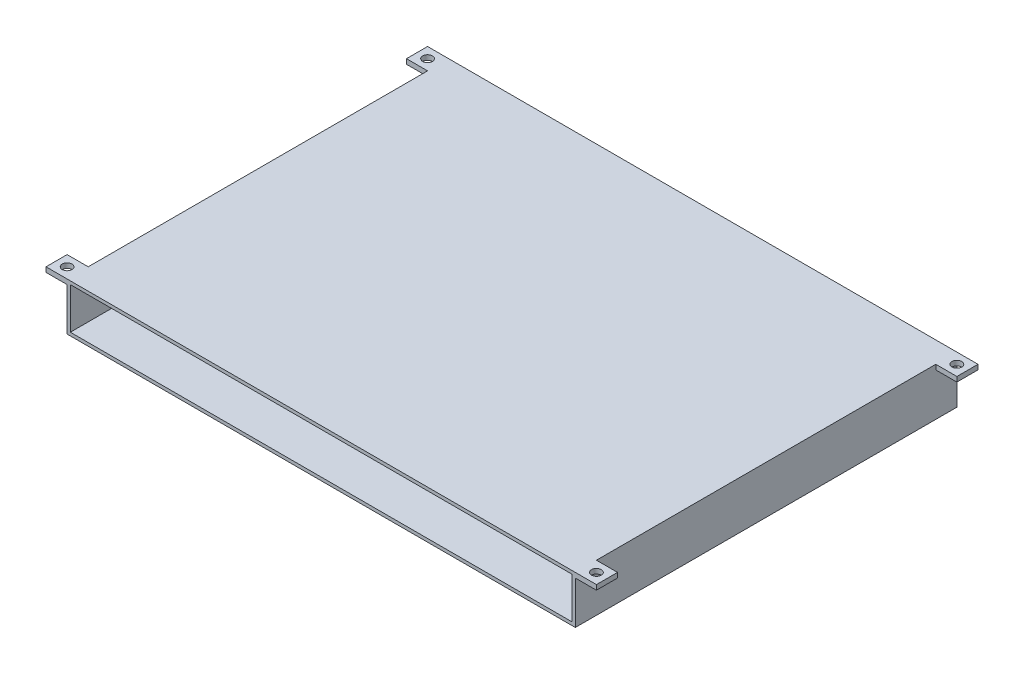
ISO-10303-21;
HEADER;
FILE_DESCRIPTION(('STEP AP214'),'2;1');
FILE_NAME('part.step','',(''),(''),'','','');
FILE_SCHEMA(('AUTOMOTIVE_DESIGN { 1 0 10303 214 1 1 1 1 }'));
ENDSEC;
DATA;
#1=APPLICATION_CONTEXT('core data for automotive mechanical design processes');
#2=APPLICATION_PROTOCOL_DEFINITION('international standard','automotive_design',2000,#1);
#3=PRODUCT_CONTEXT('',#1,'mechanical');
#4=PRODUCT('Part','Part','',(#3));
#5=PRODUCT_RELATED_PRODUCT_CATEGORY('part','',(#4));
#6=PRODUCT_DEFINITION_FORMATION('','',#4);
#7=PRODUCT_DEFINITION_CONTEXT('part definition',#1,'design');
#8=PRODUCT_DEFINITION('design','',#6,#7);
#9=PRODUCT_DEFINITION_SHAPE('','',#8);
#10=(LENGTH_UNIT() NAMED_UNIT(*) SI_UNIT(.MILLI.,.METRE.));
#11=(NAMED_UNIT(*) PLANE_ANGLE_UNIT() SI_UNIT($,.RADIAN.));
#12=(NAMED_UNIT(*) SI_UNIT($,.STERADIAN.) SOLID_ANGLE_UNIT());
#13=UNCERTAINTY_MEASURE_WITH_UNIT(LENGTH_MEASURE(1.E-05),#10,'distance_accuracy_value','');
#14=(GEOMETRIC_REPRESENTATION_CONTEXT(3) GLOBAL_UNCERTAINTY_ASSIGNED_CONTEXT((#13)) GLOBAL_UNIT_ASSIGNED_CONTEXT((#10,
#11,#12)) REPRESENTATION_CONTEXT('',''));
#15=CARTESIAN_POINT('',(0.,0.,0.));
#16=DIRECTION('',(0.,0.,1.));
#17=DIRECTION('',(1.,0.,0.));
#18=AXIS2_PLACEMENT_3D('',#15,#16,#17);
#19=CARTESIAN_POINT('',(-36.9999999998552,9.69999999999824,-32.9999999999999));
#20=DIRECTION('',(7.35349281466569E-13,1.,0.));
#21=DIRECTION('',(-1.,7.35349281466569E-13,0.));
#22=AXIS2_PLACEMENT_3D('',#19,#20,#21);
#23=PLANE('',#22);
#24=DIRECTION('',(1.,-7.35349281466568E-13,0.));
#25=VECTOR('',#24,1.);
#26=CARTESIAN_POINT('',(-36.9999999998552,9.69999999999824,-233.));
#27=LINE('',#26,#25);
#28=CARTESIAN_POINT('',(-36.9999999998552,9.69999999999824,-233.));
#29=VERTEX_POINT('',#28);
#30=CARTESIAN_POINT('',(-26.9999999998552,9.69999999999089,-233.));
#31=VERTEX_POINT('',#30);
#32=EDGE_CURVE('E107',#29,#31,#27,.T.);
#33=ORIENTED_EDGE('',*,*,#32,.F.);
#34=DIRECTION('',(0.,0.,-1.));
#35=VECTOR('',#34,1.);
#36=CARTESIAN_POINT('',(-36.9999999998552,9.69999999999824,-32.9999999999999));
#37=LINE('',#36,#35);
#38=CARTESIAN_POINT('',(-36.9999999998552,9.69999999999824,-32.9999999999999));
#39=VERTEX_POINT('',#38);
#40=EDGE_CURVE('E56',#39,#29,#37,.T.);
#41=ORIENTED_EDGE('',*,*,#40,.F.);
#42=DIRECTION('',(1.,-7.35349281466568E-13,0.));
#43=VECTOR('',#42,1.);
#44=CARTESIAN_POINT('',(-36.9999999998552,9.69999999999824,-32.9999999999999));
#45=LINE('',#44,#43);
#46=CARTESIAN_POINT('',(-26.9999999998552,9.69999999999089,-32.9999999999999));
#47=VERTEX_POINT('',#46);
#48=EDGE_CURVE('E103',#39,#47,#45,.T.);
#49=ORIENTED_EDGE('',*,*,#48,.T.);
#50=DIRECTION('',(0.,0.,-1.));
#51=VECTOR('',#50,1.);
#52=CARTESIAN_POINT('',(-26.9999999998552,9.69999999999089,-32.9999999999999));
#53=LINE('',#52,#51);
#54=EDGE_CURVE('E12',#47,#31,#53,.T.);
#55=ORIENTED_EDGE('',*,*,#54,.T.);
#56=EDGE_LOOP('',(#33,#41,#49,#55));
#57=FACE_BOUND('',#56,.T.);
#58=ADVANCED_FACE('F46',(#57),#23,.T.);
#59=CARTESIAN_POINT('',(-36.9999999998553,-1.75797938945868E-12,-32.9999999999999));
#60=DIRECTION('',(-1.,0.,0.));
#61=DIRECTION('',(0.,-1.,0.));
#62=AXIS2_PLACEMENT_3D('',#59,#60,#61);
#63=PLANE('',#62);
#64=DIRECTION('',(0.,1.,0.));
#65=VECTOR('',#64,1.);
#66=CARTESIAN_POINT('',(-36.9999999998553,-1.75797938945868E-12,-233.));
#67=LINE('',#66,#65);
#68=CARTESIAN_POINT('',(-37.0000000000133,-9.70000000000361,-233.));
#69=VERTEX_POINT('',#68);
#70=EDGE_CURVE('E92',#69,#29,#67,.T.);
#71=ORIENTED_EDGE('',*,*,#70,.F.);
#72=DIRECTION('',(0.,0.,-1.));
#73=VECTOR('',#72,1.);
#74=CARTESIAN_POINT('',(-37.0000000000133,-9.70000000000361,-32.9999999999999));
#75=LINE('',#74,#73);
#76=CARTESIAN_POINT('',(-37.0000000000133,-9.70000000000361,-32.9999999999999));
#77=VERTEX_POINT('',#76);
#78=EDGE_CURVE('E88',#77,#69,#75,.T.);
#79=ORIENTED_EDGE('',*,*,#78,.F.);
#80=DIRECTION('',(1.62906629766649E-11,1.,0.));
#81=VECTOR('',#80,1.);
#82=CARTESIAN_POINT('',(-37.0000000000133,-9.70000000000361,-32.9999999999999));
#83=LINE('',#82,#81);
#84=EDGE_CURVE('E91',#77,#39,#83,.T.);
#85=ORIENTED_EDGE('',*,*,#84,.T.);
#86=ORIENTED_EDGE('',*,*,#40,.T.);
#87=EDGE_LOOP('',(#71,#79,#85,#86));
#88=FACE_BOUND('',#87,.T.);
#89=ADVANCED_FACE('F90',(#88),#63,.T.);
#90=CARTESIAN_POINT('',(-37.0000000000133,-9.70000000000361,-32.9999999999999));
#91=DIRECTION('',(-5.46437894924215E-13,-1.,0.));
#92=DIRECTION('',(1.,-5.46437894924215E-13,0.));
#93=AXIS2_PLACEMENT_3D('',#90,#91,#92);
#94=PLANE('',#93);
#95=DIRECTION('',(-1.,5.46437894924215E-13,0.));
#96=VECTOR('',#95,1.);
#97=CARTESIAN_POINT('',(-37.0000000000133,-9.70000000000361,-233.));
#98=LINE('',#97,#96);
#99=CARTESIAN_POINT('',(-26.9999999998581,-9.70000000000907,-233.));
#100=VERTEX_POINT('',#99);
#101=EDGE_CURVE('E112',#100,#69,#98,.T.);
#102=ORIENTED_EDGE('',*,*,#101,.F.);
#103=DIRECTION('',(0.,0.,-1.));
#104=VECTOR('',#103,1.);
#105=CARTESIAN_POINT('',(-26.9999999998581,-9.70000000000907,-32.9999999999999));
#106=LINE('',#105,#104);
#107=CARTESIAN_POINT('',(-26.9999999998581,-9.70000000000907,-32.9999999999999));
#108=VERTEX_POINT('',#107);
#109=EDGE_CURVE('E50',#108,#100,#106,.T.);
#110=ORIENTED_EDGE('',*,*,#109,.F.);
#111=DIRECTION('',(-1.,5.46437894924215E-13,0.));
#112=VECTOR('',#111,1.);
#113=CARTESIAN_POINT('',(-37.0000000000133,-9.70000000000361,-32.9999999999999));
#114=LINE('',#113,#112);
#115=EDGE_CURVE('E101',#108,#77,#114,.T.);
#116=ORIENTED_EDGE('',*,*,#115,.T.);
#117=ORIENTED_EDGE('',*,*,#78,.T.);
#118=EDGE_LOOP('',(#102,#110,#116,#117));
#119=FACE_BOUND('',#118,.T.);
#120=ADVANCED_FACE('F105',(#119),#94,.T.);
#121=CARTESIAN_POINT('',(-26.9999999998553,-9.11093525808346E-12,-32.9999999999999));
#122=DIRECTION('',(1.,-2.93293453670307E-13,0.));
#123=DIRECTION('',(2.93293453670307E-13,1.,0.));
#124=AXIS2_PLACEMENT_3D('',#121,#122,#123);
#125=PLANE('',#124);
#126=DIRECTION('',(-2.93293453670307E-13,-1.,0.));
#127=VECTOR('',#126,1.);
#128=CARTESIAN_POINT('',(-26.9999999998553,-9.11093525808346E-12,-233.));
#129=LINE('',#128,#127);
#130=EDGE_CURVE('E82',#31,#100,#129,.T.);
#131=ORIENTED_EDGE('',*,*,#130,.F.);
#132=ORIENTED_EDGE('',*,*,#54,.F.);
#133=DIRECTION('',(0.,-1.,0.));
#134=VECTOR('',#133,1.);
#135=CARTESIAN_POINT('',(-26.9999999998552,9.69999999999089,-32.9999999999999));
#136=LINE('',#135,#134);
#137=EDGE_CURVE('E84',#47,#108,#136,.T.);
#138=ORIENTED_EDGE('',*,*,#137,.T.);
#139=ORIENTED_EDGE('',*,*,#109,.T.);
#140=EDGE_LOOP('',(#131,#132,#138,#139));
#141=FACE_BOUND('',#140,.T.);
#142=ADVANCED_FACE('F48',(#141),#125,.T.);
#143=CARTESIAN_POINT('',(0.,0.,-32.9999999999999));
#144=DIRECTION('',(0.,0.,1.));
#145=DIRECTION('',(1.,0.,0.));
#146=AXIS2_PLACEMENT_3D('',#143,#144,#145);
#147=PLANE('',#146);
#148=ORIENTED_EDGE('',*,*,#137,.F.);
#149=ORIENTED_EDGE('',*,*,#48,.F.);
#150=ORIENTED_EDGE('',*,*,#84,.F.);
#151=ORIENTED_EDGE('',*,*,#115,.F.);
#152=EDGE_LOOP('',(#148,#149,#150,#151));
#153=FACE_BOUND('',#152,.T.);
#154=ADVANCED_FACE('F100',(#153),#147,.T.);
#155=CARTESIAN_POINT('',(0.,0.,-233.));
#156=DIRECTION('',(0.,0.,1.));
#157=DIRECTION('',(1.,0.,0.));
#158=AXIS2_PLACEMENT_3D('',#155,#156,#157);
#159=PLANE('',#158);
#160=ORIENTED_EDGE('',*,*,#32,.T.);
#161=ORIENTED_EDGE('',*,*,#130,.T.);
#162=ORIENTED_EDGE('',*,*,#101,.T.);
#163=ORIENTED_EDGE('',*,*,#70,.T.);
#164=EDGE_LOOP('',(#160,#161,#162,#163));
#165=FACE_BOUND('',#164,.T.);
#166=ADVANCED_FACE('F119',(#165),#159,.F.);
#167=CLOSED_SHELL('',(#58,#89,#120,#142,#154,#166));
#168=MANIFOLD_SOLID_BREP('B2',#167);
#169=CARTESIAN_POINT('',(-190.,-1.741534883641E-12,0.));
#170=DIRECTION('',(-1.,0.,0.));
#171=DIRECTION('',(0.,-1.,0.));
#172=AXIS2_PLACEMENT_3D('',#169,#170,#171);
#173=PLANE('',#172);
#174=DIRECTION('',(0.,0.,-1.));
#175=VECTOR('',#174,1.);
#176=CARTESIAN_POINT('',(-190.000000000145,11.6999999999975,-222.));
#177=LINE('',#176,#175);
#178=CARTESIAN_POINT('',(-190.000000000145,11.6999999999975,-222.));
#179=VERTEX_POINT('',#178);
#180=CARTESIAN_POINT('',(-190.000000000145,11.6999999999975,-235.));
#181=VERTEX_POINT('',#180);
#182=EDGE_CURVE('E345',#179,#181,#177,.T.);
#183=ORIENTED_EDGE('',*,*,#182,.T.);
#184=DIRECTION('',(0.,1.,0.));
#185=VECTOR('',#184,1.);
#186=CARTESIAN_POINT('',(-190.,14.7,-235.));
#187=LINE('',#186,#185);
#188=CARTESIAN_POINT('',(-190.,-14.7,-235.));
#189=VERTEX_POINT('',#188);
#190=EDGE_CURVE('E319',#189,#181,#187,.T.);
#191=ORIENTED_EDGE('',*,*,#190,.F.);
#192=DIRECTION('',(0.,0.,-1.));
#193=VECTOR('',#192,1.);
#194=CARTESIAN_POINT('',(-190.,-14.7,-235.));
#195=LINE('',#194,#193);
#196=CARTESIAN_POINT('',(-190.,-14.7,0.));
#197=VERTEX_POINT('',#196);
#198=EDGE_CURVE('E428',#197,#189,#195,.T.);
#199=ORIENTED_EDGE('',*,*,#198,.F.);
#200=DIRECTION('',(0.,1.,0.));
#201=VECTOR('',#200,1.);
#202=CARTESIAN_POINT('',(-190.,-12.7,0.));
#203=LINE('',#202,#201);
#204=CARTESIAN_POINT('',(-190.000000000145,11.6999999999975,0.));
#205=VERTEX_POINT('',#204);
#206=EDGE_CURVE('E44',#197,#205,#203,.T.);
#207=ORIENTED_EDGE('',*,*,#206,.T.);
#208=DIRECTION('',(0.,0.,-1.));
#209=VECTOR('',#208,1.);
#210=CARTESIAN_POINT('',(-190.000000000145,11.6999999999975,-13.));
#211=LINE('',#210,#209);
#212=CARTESIAN_POINT('',(-190.000000000145,11.6999999999975,-13.));
#213=VERTEX_POINT('',#212);
#214=EDGE_CURVE('E356',#205,#213,#211,.T.);
#215=ORIENTED_EDGE('',*,*,#214,.T.);
#216=DIRECTION('',(0.,1.,0.));
#217=VECTOR('',#216,1.);
#218=CARTESIAN_POINT('',(-190.000000000145,14.6999999999975,-13.));
#219=LINE('',#218,#217);
#220=CARTESIAN_POINT('',(-190.,14.7,-13.));
#221=VERTEX_POINT('',#220);
#222=EDGE_CURVE('E324',#213,#221,#219,.T.);
#223=ORIENTED_EDGE('',*,*,#222,.T.);
#224=DIRECTION('',(0.,0.,1.));
#225=VECTOR('',#224,1.);
#226=CARTESIAN_POINT('',(-190.,14.7,0.));
#227=LINE('',#226,#225);
#228=CARTESIAN_POINT('',(-190.000000000145,14.6999999999975,-222.));
#229=VERTEX_POINT('',#228);
#230=EDGE_CURVE('E191',#229,#221,#227,.T.);
#231=ORIENTED_EDGE('',*,*,#230,.F.);
#232=DIRECTION('',(0.,-1.,0.));
#233=VECTOR('',#232,1.);
#234=CARTESIAN_POINT('',(-190.000000000145,14.6999999999975,-222.));
#235=LINE('',#234,#233);
#236=EDGE_CURVE('E335',#229,#179,#235,.T.);
#237=ORIENTED_EDGE('',*,*,#236,.T.);
#238=EDGE_LOOP('',(#183,#191,#199,#207,#215,#223,#231,#237));
#239=FACE_BOUND('',#238,.T.);
#240=ADVANCED_FACE('F175',(#239),#173,.T.);
#241=CARTESIAN_POINT('',(123.000000000145,1.3440692128844E-13,0.));
#242=DIRECTION('',(-1.,0.,0.));
#243=DIRECTION('',(0.,-1.,0.));
#244=AXIS2_PLACEMENT_3D('',#241,#242,#243);
#245=PLANE('',#244);
#246=DIRECTION('',(0.,-1.,0.));
#247=VECTOR('',#246,1.);
#248=CARTESIAN_POINT('',(123.000000000145,14.7000000000004,-222.));
#249=LINE('',#248,#247);
#250=CARTESIAN_POINT('',(123.000000000145,14.7000000000004,-222.));
#251=VERTEX_POINT('',#250);
#252=CARTESIAN_POINT('',(123.000000000145,11.7000000000004,-222.));
#253=VERTEX_POINT('',#252);
#254=EDGE_CURVE('E375',#251,#253,#249,.T.);
#255=ORIENTED_EDGE('',*,*,#254,.F.);
#256=DIRECTION('',(0.,0.,-1.));
#257=VECTOR('',#256,1.);
#258=CARTESIAN_POINT('',(123.000000000145,14.7000000000004,0.));
#259=LINE('',#258,#257);
#260=CARTESIAN_POINT('',(123.000000000145,14.7000000000004,-13.));
#261=VERTEX_POINT('',#260);
#262=EDGE_CURVE('E437',#261,#251,#259,.T.);
#263=ORIENTED_EDGE('',*,*,#262,.F.);
#264=DIRECTION('',(0.,1.,0.));
#265=VECTOR('',#264,1.);
#266=CARTESIAN_POINT('',(123.000000000145,14.7000000000004,-13.));
#267=LINE('',#266,#265);
#268=CARTESIAN_POINT('',(123.000000000145,11.7000000000004,-13.));
#269=VERTEX_POINT('',#268);
#270=EDGE_CURVE('E399',#269,#261,#267,.T.);
#271=ORIENTED_EDGE('',*,*,#270,.F.);
#272=DIRECTION('',(0.,0.,-1.));
#273=VECTOR('',#272,1.);
#274=CARTESIAN_POINT('',(123.000000000145,11.7000000000004,-13.));
#275=LINE('',#274,#273);
#276=CARTESIAN_POINT('',(123.000000000145,11.7000000000004,0.));
#277=VERTEX_POINT('',#276);
#278=EDGE_CURVE('E394',#277,#269,#275,.T.);
#279=ORIENTED_EDGE('',*,*,#278,.F.);
#280=DIRECTION('',(0.,1.,0.));
#281=VECTOR('',#280,1.);
#282=CARTESIAN_POINT('',(123.000000000145,-12.6999999999996,0.));
#283=LINE('',#282,#281);
#284=CARTESIAN_POINT('',(123.000000000145,-14.6999999999996,0.));
#285=VERTEX_POINT('',#284);
#286=EDGE_CURVE('E434',#285,#277,#283,.T.);
#287=ORIENTED_EDGE('',*,*,#286,.F.);
#288=DIRECTION('',(0.,0.,1.));
#289=VECTOR('',#288,1.);
#290=CARTESIAN_POINT('',(123.000000000145,-14.6999999999996,-235.));
#291=LINE('',#290,#289);
#292=CARTESIAN_POINT('',(123.000000000145,-14.6999999999996,-235.));
#293=VERTEX_POINT('',#292);
#294=EDGE_CURVE('E422',#293,#285,#291,.T.);
#295=ORIENTED_EDGE('',*,*,#294,.F.);
#296=DIRECTION('',(0.,-1.,0.));
#297=VECTOR('',#296,1.);
#298=CARTESIAN_POINT('',(123.000000000145,14.7000000000004,-235.));
#299=LINE('',#298,#297);
#300=CARTESIAN_POINT('',(123.000000000145,11.7000000000004,-235.));
#301=VERTEX_POINT('',#300);
#302=EDGE_CURVE('E441',#301,#293,#299,.T.);
#303=ORIENTED_EDGE('',*,*,#302,.F.);
#304=DIRECTION('',(0.,0.,-1.));
#305=VECTOR('',#304,1.);
#306=CARTESIAN_POINT('',(123.000000000145,11.7000000000004,-222.));
#307=LINE('',#306,#305);
#308=EDGE_CURVE('E380',#253,#301,#307,.T.);
#309=ORIENTED_EDGE('',*,*,#308,.F.);
#310=EDGE_LOOP('',(#255,#263,#271,#279,#287,#295,#303,#309));
#311=FACE_BOUND('',#310,.T.);
#312=ADVANCED_FACE('F507',(#311),#245,.F.);
#313=CARTESIAN_POINT('',(-190.,12.7,0.));
#314=DIRECTION('',(0.,0.,-1.));
#315=DIRECTION('',(-1.,0.,0.));
#316=AXIS2_PLACEMENT_3D('',#313,#314,#315);
#317=PLANE('',#316);
#318=DIRECTION('',(-1.,0.,0.));
#319=VECTOR('',#318,1.);
#320=CARTESIAN_POINT('',(-190.,-12.7,0.));
#321=LINE('',#320,#319);
#322=CARTESIAN_POINT('',(121.000000000145,-12.6999999999996,0.));
#323=VERTEX_POINT('',#322);
#324=CARTESIAN_POINT('',(-188.,-12.7,0.));
#325=VERTEX_POINT('',#324);
#326=EDGE_CURVE('E418',#323,#325,#321,.T.);
#327=ORIENTED_EDGE('',*,*,#326,.T.);
#328=DIRECTION('',(0.,1.,0.));
#329=VECTOR('',#328,1.);
#330=CARTESIAN_POINT('',(-188.,12.7,0.));
#331=LINE('',#330,#329);
#332=CARTESIAN_POINT('',(-188.,12.7,0.));
#333=VERTEX_POINT('',#332);
#334=EDGE_CURVE('E470',#325,#333,#331,.T.);
#335=ORIENTED_EDGE('',*,*,#334,.T.);
#336=DIRECTION('',(1.,0.,0.));
#337=VECTOR('',#336,1.);
#338=CARTESIAN_POINT('',(121.000000000144,12.7000000000004,0.));
#339=LINE('',#338,#337);
#340=CARTESIAN_POINT('',(121.000000000144,12.7000000000004,0.));
#341=VERTEX_POINT('',#340);
#342=EDGE_CURVE('E451',#333,#341,#339,.T.);
#343=ORIENTED_EDGE('',*,*,#342,.T.);
#344=DIRECTION('',(0.,1.,0.));
#345=VECTOR('',#344,1.);
#346=CARTESIAN_POINT('',(121.000000000145,12.7000000000004,0.));
#347=LINE('',#346,#345);
#348=EDGE_CURVE('E438',#323,#341,#347,.T.);
#349=ORIENTED_EDGE('',*,*,#348,.F.);
#350=EDGE_LOOP('',(#327,#335,#343,#349));
#351=FACE_BOUND('',#350,.T.);
#352=ORIENTED_EDGE('',*,*,#206,.F.);
#353=DIRECTION('',(-1.,0.,0.));
#354=VECTOR('',#353,1.);
#355=CARTESIAN_POINT('',(-190.,-14.7,0.));
#356=LINE('',#355,#354);
#357=EDGE_CURVE('E425',#285,#197,#356,.T.);
#358=ORIENTED_EDGE('',*,*,#357,.F.);
#359=ORIENTED_EDGE('',*,*,#286,.T.);
#360=DIRECTION('',(-1.,0.,0.));
#361=VECTOR('',#360,1.);
#362=CARTESIAN_POINT('',(136.000000000145,11.7000000000004,0.));
#363=LINE('',#362,#361);
#364=CARTESIAN_POINT('',(136.000000000145,11.7000000000004,0.));
#365=VERTEX_POINT('',#364);
#366=EDGE_CURVE('E415',#365,#277,#363,.T.);
#367=ORIENTED_EDGE('',*,*,#366,.F.);
#368=DIRECTION('',(0.,-1.,0.));
#369=VECTOR('',#368,1.);
#370=CARTESIAN_POINT('',(136.000000000145,11.7000000000004,0.));
#371=LINE('',#370,#369);
#372=CARTESIAN_POINT('',(136.000000000145,14.7000000000004,0.));
#373=VERTEX_POINT('',#372);
#374=EDGE_CURVE('E398',#373,#365,#371,.T.);
#375=ORIENTED_EDGE('',*,*,#374,.F.);
#376=DIRECTION('',(1.,0.,0.));
#377=VECTOR('',#376,1.);
#378=CARTESIAN_POINT('',(-190.,14.7,0.));
#379=LINE('',#378,#377);
#380=CARTESIAN_POINT('',(-203.000000000145,14.6999999999972,0.));
#381=VERTEX_POINT('',#380);
#382=EDGE_CURVE('E457',#381,#373,#379,.T.);
#383=ORIENTED_EDGE('',*,*,#382,.F.);
#384=DIRECTION('',(0.,-1.,0.));
#385=VECTOR('',#384,1.);
#386=CARTESIAN_POINT('',(-203.000000000145,11.6999999999972,0.));
#387=LINE('',#386,#385);
#388=CARTESIAN_POINT('',(-203.000000000145,11.6999999999972,0.));
#389=VERTEX_POINT('',#388);
#390=EDGE_CURVE('E362',#381,#389,#387,.T.);
#391=ORIENTED_EDGE('',*,*,#390,.T.);
#392=DIRECTION('',(1.,0.,0.));
#393=VECTOR('',#392,1.);
#394=CARTESIAN_POINT('',(-203.000000000145,11.6999999999972,0.));
#395=LINE('',#394,#393);
#396=EDGE_CURVE('E365',#389,#205,#395,.T.);
#397=ORIENTED_EDGE('',*,*,#396,.T.);
#398=EDGE_LOOP('',(#352,#358,#359,#367,#375,#383,#391,#397));
#399=FACE_BOUND('',#398,.T.);
#400=ADVANCED_FACE('F177',(#351,#399),#317,.F.);
#401=CARTESIAN_POINT('',(-188.,-1.73934940524607E-12,0.));
#402=DIRECTION('',(-1.,0.,0.));
#403=DIRECTION('',(0.,-1.,0.));
#404=AXIS2_PLACEMENT_3D('',#401,#402,#403);
#405=PLANE('',#404);
#406=DIRECTION('',(0.,-1.,0.));
#407=VECTOR('',#406,1.);
#408=CARTESIAN_POINT('',(-188.,-12.7,-233.));
#409=LINE('',#408,#407);
#410=CARTESIAN_POINT('',(-188.,12.7,-233.));
#411=VERTEX_POINT('',#410);
#412=CARTESIAN_POINT('',(-188.,-12.7,-233.));
#413=VERTEX_POINT('',#412);
#414=EDGE_CURVE('E460',#411,#413,#409,.T.);
#415=ORIENTED_EDGE('',*,*,#414,.F.);
#416=DIRECTION('',(0.,0.,-1.));
#417=VECTOR('',#416,1.);
#418=CARTESIAN_POINT('',(-188.,12.7,-59.));
#419=LINE('',#418,#417);
#420=EDGE_CURVE('E179',#333,#411,#419,.T.);
#421=ORIENTED_EDGE('',*,*,#420,.F.);
#422=ORIENTED_EDGE('',*,*,#334,.F.);
#423=DIRECTION('',(0.,0.,1.));
#424=VECTOR('',#423,1.);
#425=CARTESIAN_POINT('',(-188.,-12.7,-57.));
#426=LINE('',#425,#424);
#427=EDGE_CURVE('E468',#413,#325,#426,.T.);
#428=ORIENTED_EDGE('',*,*,#427,.F.);
#429=EDGE_LOOP('',(#415,#421,#422,#428));
#430=FACE_BOUND('',#429,.T.);
#431=ADVANCED_FACE('F481',(#430),#405,.F.);
#432=CARTESIAN_POINT('',(0.,14.7000000000004,0.));
#433=DIRECTION('',(0.,-1.,0.));
#434=DIRECTION('',(1.,0.,0.));
#435=AXIS2_PLACEMENT_3D('',#432,#433,#434);
#436=PLANE('',#435);
#437=CARTESIAN_POINT('',(-196.500000000145,14.7,-228.5));
#438=DIRECTION('',(0.,-1.,0.));
#439=DIRECTION('',(1.,0.,0.));
#440=AXIS2_PLACEMENT_3D('',#437,#438,#439);
#441=CIRCLE('',#440,2.99999999999999);
#442=CARTESIAN_POINT('',(-193.500000000145,14.7,-228.5));
#443=VERTEX_POINT('',#442);
#444=EDGE_CURVE('E768',#443,#443,#441,.F.);
#445=ORIENTED_EDGE('',*,*,#444,.F.);
#446=EDGE_LOOP('',(#445));
#447=FACE_BOUND('',#446,.T.);
#448=CARTESIAN_POINT('',(-196.500000000145,14.7,-6.50000000000001));
#449=DIRECTION('',(0.,-1.,0.));
#450=DIRECTION('',(1.,0.,0.));
#451=AXIS2_PLACEMENT_3D('',#448,#449,#450);
#452=CIRCLE('',#451,2.99999999999999);
#453=CARTESIAN_POINT('',(-193.500000000145,14.7,-6.50000000000001));
#454=VERTEX_POINT('',#453);
#455=EDGE_CURVE('E759',#454,#454,#452,.F.);
#456=ORIENTED_EDGE('',*,*,#455,.F.);
#457=EDGE_LOOP('',(#456));
#458=FACE_BOUND('',#457,.T.);
#459=CARTESIAN_POINT('',(129.500000000145,14.7000000000006,-228.5));
#460=DIRECTION('',(0.,-1.,0.));
#461=DIRECTION('',(1.,0.,0.));
#462=AXIS2_PLACEMENT_3D('',#459,#460,#461);
#463=CIRCLE('',#462,2.99999999999999);
#464=CARTESIAN_POINT('',(132.500000000145,14.7000000000006,-228.5));
#465=VERTEX_POINT('',#464);
#466=EDGE_CURVE('E753',#465,#465,#463,.T.);
#467=ORIENTED_EDGE('',*,*,#466,.T.);
#468=EDGE_LOOP('',(#467));
#469=FACE_BOUND('',#468,.T.);
#470=CARTESIAN_POINT('',(129.500000000145,14.7000000000006,-6.50000000000001));
#471=DIRECTION('',(0.,-1.,0.));
#472=DIRECTION('',(1.,0.,0.));
#473=AXIS2_PLACEMENT_3D('',#470,#471,#472);
#474=CIRCLE('',#473,2.99999999999999);
#475=CARTESIAN_POINT('',(132.500000000145,14.7000000000006,-6.50000000000001));
#476=VERTEX_POINT('',#475);
#477=EDGE_CURVE('E347',#476,#476,#474,.T.);
#478=ORIENTED_EDGE('',*,*,#477,.T.);
#479=EDGE_LOOP('',(#478));
#480=FACE_BOUND('',#479,.T.);
#481=DIRECTION('',(1.,0.,0.));
#482=VECTOR('',#481,1.);
#483=CARTESIAN_POINT('',(121.000000000145,14.7000000000004,-235.));
#484=LINE('',#483,#482);
#485=CARTESIAN_POINT('',(-203.000000000145,14.6999999999972,-235.));
#486=VERTEX_POINT('',#485);
#487=CARTESIAN_POINT('',(136.000000000145,14.7000000000004,-235.));
#488=VERTEX_POINT('',#487);
#489=EDGE_CURVE('E448',#486,#488,#484,.T.);
#490=ORIENTED_EDGE('',*,*,#489,.F.);
#491=DIRECTION('',(0.,0.,1.));
#492=VECTOR('',#491,1.);
#493=CARTESIAN_POINT('',(-203.000000000145,14.6999999999972,-235.));
#494=LINE('',#493,#492);
#495=CARTESIAN_POINT('',(-203.000000000145,14.6999999999973,-222.));
#496=VERTEX_POINT('',#495);
#497=EDGE_CURVE('E334',#486,#496,#494,.T.);
#498=ORIENTED_EDGE('',*,*,#497,.T.);
#499=DIRECTION('',(1.,0.,0.));
#500=VECTOR('',#499,1.);
#501=CARTESIAN_POINT('',(-203.000000000145,14.6999999999973,-222.));
#502=LINE('',#501,#500);
#503=EDGE_CURVE('E344',#496,#229,#502,.T.);
#504=ORIENTED_EDGE('',*,*,#503,.T.);
#505=ORIENTED_EDGE('',*,*,#230,.T.);
#506=DIRECTION('',(1.,0.,0.));
#507=VECTOR('',#506,1.);
#508=CARTESIAN_POINT('',(-203.000000000145,14.6999999999972,-13.));
#509=LINE('',#508,#507);
#510=CARTESIAN_POINT('',(-203.000000000145,14.6999999999972,-13.));
#511=VERTEX_POINT('',#510);
#512=EDGE_CURVE('E373',#511,#221,#509,.T.);
#513=ORIENTED_EDGE('',*,*,#512,.F.);
#514=DIRECTION('',(0.,0.,1.));
#515=VECTOR('',#514,1.);
#516=CARTESIAN_POINT('',(-203.000000000145,14.6999999999972,0.));
#517=LINE('',#516,#515);
#518=EDGE_CURVE('E352',#511,#381,#517,.T.);
#519=ORIENTED_EDGE('',*,*,#518,.T.);
#520=ORIENTED_EDGE('',*,*,#382,.T.);
#521=DIRECTION('',(0.,0.,1.));
#522=VECTOR('',#521,1.);
#523=CARTESIAN_POINT('',(136.000000000145,14.7000000000004,0.));
#524=LINE('',#523,#522);
#525=CARTESIAN_POINT('',(136.000000000145,14.7000000000004,-13.));
#526=VERTEX_POINT('',#525);
#527=EDGE_CURVE('E395',#526,#373,#524,.T.);
#528=ORIENTED_EDGE('',*,*,#527,.F.);
#529=DIRECTION('',(-1.,0.,0.));
#530=VECTOR('',#529,1.);
#531=CARTESIAN_POINT('',(136.000000000145,14.7000000000004,-13.));
#532=LINE('',#531,#530);
#533=EDGE_CURVE('E405',#526,#261,#532,.T.);
#534=ORIENTED_EDGE('',*,*,#533,.T.);
#535=ORIENTED_EDGE('',*,*,#262,.T.);
#536=DIRECTION('',(-1.,0.,0.));
#537=VECTOR('',#536,1.);
#538=CARTESIAN_POINT('',(136.000000000145,14.7000000000004,-222.));
#539=LINE('',#538,#537);
#540=CARTESIAN_POINT('',(136.000000000145,14.7000000000004,-222.));
#541=VERTEX_POINT('',#540);
#542=EDGE_CURVE('E392',#541,#251,#539,.T.);
#543=ORIENTED_EDGE('',*,*,#542,.F.);
#544=DIRECTION('',(0.,0.,1.));
#545=VECTOR('',#544,1.);
#546=CARTESIAN_POINT('',(136.000000000145,14.7000000000004,-235.));
#547=LINE('',#546,#545);
#548=EDGE_CURVE('E379',#488,#541,#547,.T.);
#549=ORIENTED_EDGE('',*,*,#548,.F.);
#550=EDGE_LOOP('',(#490,#498,#504,#505,#513,#519,#520,#528,#534,#535,#543,#549));
#551=FACE_BOUND('',#550,.T.);
#552=ADVANCED_FACE('F517',(#447,#458,#469,#480,#551),#436,.F.);
#553=CARTESIAN_POINT('',(0.,12.7000000000004,0.));
#554=DIRECTION('',(0.,-1.,0.));
#555=DIRECTION('',(1.,0.,0.));
#556=AXIS2_PLACEMENT_3D('',#553,#554,#555);
#557=PLANE('',#556);
#558=ORIENTED_EDGE('',*,*,#342,.F.);
#559=ORIENTED_EDGE('',*,*,#420,.T.);
#560=DIRECTION('',(-1.,0.,0.));
#561=VECTOR('',#560,1.);
#562=CARTESIAN_POINT('',(-190.,12.7,-233.));
#563=LINE('',#562,#561);
#564=CARTESIAN_POINT('',(121.000000000145,12.7000000000004,-233.));
#565=VERTEX_POINT('',#564);
#566=EDGE_CURVE('E458',#565,#411,#563,.T.);
#567=ORIENTED_EDGE('',*,*,#566,.F.);
#568=DIRECTION('',(0.,0.,-1.));
#569=VECTOR('',#568,1.);
#570=CARTESIAN_POINT('',(121.000000000145,12.7000000000004,-59.));
#571=LINE('',#570,#569);
#572=EDGE_CURVE('E462',#341,#565,#571,.T.);
#573=ORIENTED_EDGE('',*,*,#572,.F.);
#574=EDGE_LOOP('',(#558,#559,#567,#573));
#575=FACE_BOUND('',#574,.T.);
#576=ADVANCED_FACE('F476',(#575),#557,.T.);
#577=CARTESIAN_POINT('',(0.,0.,-233.));
#578=DIRECTION('',(0.,0.,-1.));
#579=DIRECTION('',(-1.,0.,0.));
#580=AXIS2_PLACEMENT_3D('',#577,#578,#579);
#581=PLANE('',#580);
#582=ORIENTED_EDGE('',*,*,#566,.T.);
#583=ORIENTED_EDGE('',*,*,#414,.T.);
#584=DIRECTION('',(-1.,0.,0.));
#585=VECTOR('',#584,1.);
#586=CARTESIAN_POINT('',(111.000000000145,-12.7,-233.));
#587=LINE('',#586,#585);
#588=CARTESIAN_POINT('',(121.000000000145,-12.7,-233.));
#589=VERTEX_POINT('',#588);
#590=EDGE_CURVE('E449',#589,#413,#587,.T.);
#591=ORIENTED_EDGE('',*,*,#590,.F.);
#592=DIRECTION('',(0.,-1.,0.));
#593=VECTOR('',#592,1.);
#594=CARTESIAN_POINT('',(121.000000000145,12.7000000000004,-233.));
#595=LINE('',#594,#593);
#596=EDGE_CURVE('E443',#565,#589,#595,.T.);
#597=ORIENTED_EDGE('',*,*,#596,.F.);
#598=EDGE_LOOP('',(#582,#583,#591,#597));
#599=FACE_BOUND('',#598,.T.);
#600=ADVANCED_FACE('F483',(#599),#581,.F.);
#601=CARTESIAN_POINT('',(0.,0.,-235.));
#602=DIRECTION('',(0.,0.,-1.));
#603=DIRECTION('',(-1.,0.,0.));
#604=AXIS2_PLACEMENT_3D('',#601,#602,#603);
#605=PLANE('',#604);
#606=ORIENTED_EDGE('',*,*,#489,.T.);
#607=DIRECTION('',(0.,1.,0.));
#608=VECTOR('',#607,1.);
#609=CARTESIAN_POINT('',(136.000000000145,11.7000000000004,-235.));
#610=LINE('',#609,#608);
#611=CARTESIAN_POINT('',(136.000000000145,11.7000000000004,-235.));
#612=VERTEX_POINT('',#611);
#613=EDGE_CURVE('E376',#612,#488,#610,.T.);
#614=ORIENTED_EDGE('',*,*,#613,.F.);
#615=DIRECTION('',(-1.,0.,0.));
#616=VECTOR('',#615,1.);
#617=CARTESIAN_POINT('',(136.000000000145,11.7000000000004,-235.));
#618=LINE('',#617,#616);
#619=EDGE_CURVE('E199',#612,#301,#618,.T.);
#620=ORIENTED_EDGE('',*,*,#619,.T.);
#621=ORIENTED_EDGE('',*,*,#302,.T.);
#622=DIRECTION('',(1.,0.,0.));
#623=VECTOR('',#622,1.);
#624=CARTESIAN_POINT('',(123.000000000145,-14.6999999999996,-235.));
#625=LINE('',#624,#623);
#626=EDGE_CURVE('E419',#189,#293,#625,.T.);
#627=ORIENTED_EDGE('',*,*,#626,.F.);
#628=ORIENTED_EDGE('',*,*,#190,.T.);
#629=DIRECTION('',(1.,0.,0.));
#630=VECTOR('',#629,1.);
#631=CARTESIAN_POINT('',(-203.000000000145,11.6999999999972,-235.));
#632=LINE('',#631,#630);
#633=CARTESIAN_POINT('',(-203.000000000145,11.6999999999972,-235.));
#634=VERTEX_POINT('',#633);
#635=EDGE_CURVE('E313',#634,#181,#632,.T.);
#636=ORIENTED_EDGE('',*,*,#635,.F.);
#637=DIRECTION('',(0.,1.,0.));
#638=VECTOR('',#637,1.);
#639=CARTESIAN_POINT('',(-203.000000000145,11.6999999999972,-235.));
#640=LINE('',#639,#638);
#641=EDGE_CURVE('E316',#634,#486,#640,.T.);
#642=ORIENTED_EDGE('',*,*,#641,.T.);
#643=EDGE_LOOP('',(#606,#614,#620,#621,#627,#628,#636,#642));
#644=FACE_BOUND('',#643,.T.);
#645=ADVANCED_FACE('F315',(#644),#605,.T.);
#646=CARTESIAN_POINT('',(121.000000000145,1.32221442893509E-13,0.));
#647=DIRECTION('',(-1.,0.,0.));
#648=DIRECTION('',(0.,-1.,0.));
#649=AXIS2_PLACEMENT_3D('',#646,#647,#648);
#650=PLANE('',#649);
#651=ORIENTED_EDGE('',*,*,#348,.T.);
#652=ORIENTED_EDGE('',*,*,#572,.T.);
#653=ORIENTED_EDGE('',*,*,#596,.T.);
#654=DIRECTION('',(0.,0.,1.));
#655=VECTOR('',#654,1.);
#656=CARTESIAN_POINT('',(121.000000000145,-12.7,-235.));
#657=LINE('',#656,#655);
#658=EDGE_CURVE('E431',#589,#323,#657,.T.);
#659=ORIENTED_EDGE('',*,*,#658,.T.);
#660=EDGE_LOOP('',(#651,#652,#653,#659));
#661=FACE_BOUND('',#660,.T.);
#662=ADVANCED_FACE('F486',(#661),#650,.T.);
#663=CARTESIAN_POINT('',(0.,-14.6999999999998,0.));
#664=DIRECTION('',(0.,1.,0.));
#665=DIRECTION('',(-1.,0.,0.));
#666=AXIS2_PLACEMENT_3D('',#663,#664,#665);
#667=PLANE('',#666);
#668=ORIENTED_EDGE('',*,*,#626,.T.);
#669=ORIENTED_EDGE('',*,*,#294,.T.);
#670=ORIENTED_EDGE('',*,*,#357,.T.);
#671=ORIENTED_EDGE('',*,*,#198,.T.);
#672=EDGE_LOOP('',(#668,#669,#670,#671));
#673=FACE_BOUND('',#672,.T.);
#674=ADVANCED_FACE('F494',(#673),#667,.F.);
#675=CARTESIAN_POINT('',(0.,-12.6999999999998,0.));
#676=DIRECTION('',(0.,1.,0.));
#677=DIRECTION('',(-1.,0.,0.));
#678=AXIS2_PLACEMENT_3D('',#675,#676,#677);
#679=PLANE('',#678);
#680=ORIENTED_EDGE('',*,*,#590,.T.);
#681=ORIENTED_EDGE('',*,*,#427,.T.);
#682=ORIENTED_EDGE('',*,*,#326,.F.);
#683=ORIENTED_EDGE('',*,*,#658,.F.);
#684=EDGE_LOOP('',(#680,#681,#682,#683));
#685=FACE_BOUND('',#684,.T.);
#686=ADVANCED_FACE('F491',(#685),#679,.T.);
#687=CARTESIAN_POINT('',(136.000000000145,11.7000000000004,-13.));
#688=DIRECTION('',(0.,1.,0.));
#689=DIRECTION('',(-1.,0.,0.));
#690=AXIS2_PLACEMENT_3D('',#687,#688,#689);
#691=PLANE('',#690);
#692=CARTESIAN_POINT('',(129.500000000145,11.7000000000009,-6.5));
#693=DIRECTION('',(0.,-1.,0.));
#694=DIRECTION('',(0.,0.,-1.));
#695=AXIS2_PLACEMENT_3D('',#692,#693,#694);
#696=CIRCLE('',#695,2.99999999999999);
#697=CARTESIAN_POINT('',(129.500000000145,11.7000000000009,-9.5));
#698=VERTEX_POINT('',#697);
#699=EDGE_CURVE('E754',#698,#698,#696,.T.);
#700=ORIENTED_EDGE('',*,*,#699,.F.);
#701=EDGE_LOOP('',(#700));
#702=FACE_BOUND('',#701,.T.);
#703=ORIENTED_EDGE('',*,*,#278,.T.);
#704=DIRECTION('',(-1.,0.,0.));
#705=VECTOR('',#704,1.);
#706=CARTESIAN_POINT('',(136.000000000145,11.7000000000004,-13.));
#707=LINE('',#706,#705);
#708=CARTESIAN_POINT('',(136.000000000145,11.7000000000004,-13.));
#709=VERTEX_POINT('',#708);
#710=EDGE_CURVE('E412',#709,#269,#707,.T.);
#711=ORIENTED_EDGE('',*,*,#710,.F.);
#712=DIRECTION('',(0.,0.,-1.));
#713=VECTOR('',#712,1.);
#714=CARTESIAN_POINT('',(136.000000000145,11.7000000000004,-13.));
#715=LINE('',#714,#713);
#716=EDGE_CURVE('E401',#365,#709,#715,.T.);
#717=ORIENTED_EDGE('',*,*,#716,.F.);
#718=ORIENTED_EDGE('',*,*,#366,.T.);
#719=EDGE_LOOP('',(#703,#711,#717,#718));
#720=FACE_BOUND('',#719,.T.);
#721=ADVANCED_FACE('F493',(#702,#720),#691,.F.);
#722=CARTESIAN_POINT('',(136.000000000145,14.7000000000004,-13.));
#723=DIRECTION('',(0.,0.,1.));
#724=DIRECTION('',(0.,-1.,0.));
#725=AXIS2_PLACEMENT_3D('',#722,#723,#724);
#726=PLANE('',#725);
#727=ORIENTED_EDGE('',*,*,#270,.T.);
#728=ORIENTED_EDGE('',*,*,#533,.F.);
#729=DIRECTION('',(0.,1.,0.));
#730=VECTOR('',#729,1.);
#731=CARTESIAN_POINT('',(136.000000000145,14.7000000000004,-13.));
#732=LINE('',#731,#730);
#733=EDGE_CURVE('E403',#709,#526,#732,.T.);
#734=ORIENTED_EDGE('',*,*,#733,.F.);
#735=ORIENTED_EDGE('',*,*,#710,.T.);
#736=EDGE_LOOP('',(#727,#728,#734,#735));
#737=FACE_BOUND('',#736,.T.);
#738=ADVANCED_FACE('F500',(#737),#726,.F.);
#739=CARTESIAN_POINT('',(136.000000000145,0.,0.));
#740=DIRECTION('',(-1.,0.,0.));
#741=DIRECTION('',(0.,0.,1.));
#742=AXIS2_PLACEMENT_3D('',#739,#740,#741);
#743=PLANE('',#742);
#744=ORIENTED_EDGE('',*,*,#527,.T.);
#745=ORIENTED_EDGE('',*,*,#374,.T.);
#746=ORIENTED_EDGE('',*,*,#716,.T.);
#747=ORIENTED_EDGE('',*,*,#733,.T.);
#748=EDGE_LOOP('',(#744,#745,#746,#747));
#749=FACE_BOUND('',#748,.T.);
#750=ADVANCED_FACE('F544',(#749),#743,.F.);
#751=CARTESIAN_POINT('',(136.000000000145,14.7000000000004,-222.));
#752=DIRECTION('',(0.,0.,-1.));
#753=DIRECTION('',(-1.,0.,0.));
#754=AXIS2_PLACEMENT_3D('',#751,#752,#753);
#755=PLANE('',#754);
#756=ORIENTED_EDGE('',*,*,#254,.T.);
#757=DIRECTION('',(-1.,0.,0.));
#758=VECTOR('',#757,1.);
#759=CARTESIAN_POINT('',(136.000000000145,11.7000000000004,-222.));
#760=LINE('',#759,#758);
#761=CARTESIAN_POINT('',(136.000000000145,11.7000000000004,-222.));
#762=VERTEX_POINT('',#761);
#763=EDGE_CURVE('E389',#762,#253,#760,.T.);
#764=ORIENTED_EDGE('',*,*,#763,.F.);
#765=DIRECTION('',(0.,-1.,0.));
#766=VECTOR('',#765,1.);
#767=CARTESIAN_POINT('',(136.000000000145,14.7000000000004,-222.));
#768=LINE('',#767,#766);
#769=EDGE_CURVE('E382',#541,#762,#768,.T.);
#770=ORIENTED_EDGE('',*,*,#769,.F.);
#771=ORIENTED_EDGE('',*,*,#542,.T.);
#772=EDGE_LOOP('',(#756,#764,#770,#771));
#773=FACE_BOUND('',#772,.T.);
#774=ADVANCED_FACE('F555',(#773),#755,.F.);
#775=CARTESIAN_POINT('',(136.000000000145,11.7000000000004,-222.));
#776=DIRECTION('',(0.,1.,0.));
#777=DIRECTION('',(0.,0.,1.));
#778=AXIS2_PLACEMENT_3D('',#775,#776,#777);
#779=PLANE('',#778);
#780=CARTESIAN_POINT('',(129.500000000145,11.7000000000004,-228.5));
#781=DIRECTION('',(0.,-1.,0.));
#782=DIRECTION('',(0.,0.,-1.));
#783=AXIS2_PLACEMENT_3D('',#780,#781,#782);
#784=CIRCLE('',#783,2.99999999999999);
#785=CARTESIAN_POINT('',(129.500000000145,11.7000000000004,-231.5));
#786=VERTEX_POINT('',#785);
#787=EDGE_CURVE('E725',#786,#786,#784,.T.);
#788=ORIENTED_EDGE('',*,*,#787,.F.);
#789=EDGE_LOOP('',(#788));
#790=FACE_BOUND('',#789,.T.);
#791=ORIENTED_EDGE('',*,*,#308,.T.);
#792=ORIENTED_EDGE('',*,*,#619,.F.);
#793=DIRECTION('',(0.,0.,-1.));
#794=VECTOR('',#793,1.);
#795=CARTESIAN_POINT('',(136.000000000145,11.7000000000004,-222.));
#796=LINE('',#795,#794);
#797=EDGE_CURVE('E384',#762,#612,#796,.T.);
#798=ORIENTED_EDGE('',*,*,#797,.F.);
#799=ORIENTED_EDGE('',*,*,#763,.T.);
#800=EDGE_LOOP('',(#791,#792,#798,#799));
#801=FACE_BOUND('',#800,.T.);
#802=ADVANCED_FACE('F565',(#790,#801),#779,.F.);
#803=CARTESIAN_POINT('',(136.000000000145,0.,0.));
#804=DIRECTION('',(1.,0.,0.));
#805=DIRECTION('',(0.,0.,-1.));
#806=AXIS2_PLACEMENT_3D('',#803,#804,#805);
#807=PLANE('',#806);
#808=ORIENTED_EDGE('',*,*,#613,.T.);
#809=ORIENTED_EDGE('',*,*,#548,.T.);
#810=ORIENTED_EDGE('',*,*,#769,.T.);
#811=ORIENTED_EDGE('',*,*,#797,.T.);
#812=EDGE_LOOP('',(#808,#809,#810,#811));
#813=FACE_BOUND('',#812,.T.);
#814=ADVANCED_FACE('F573',(#813),#807,.T.);
#815=CARTESIAN_POINT('',(-203.000000000145,14.6999999999972,-13.));
#816=DIRECTION('',(0.,0.,-1.));
#817=DIRECTION('',(0.,1.,0.));
#818=AXIS2_PLACEMENT_3D('',#815,#816,#817);
#819=PLANE('',#818);
#820=ORIENTED_EDGE('',*,*,#222,.F.);
#821=DIRECTION('',(1.,0.,0.));
#822=VECTOR('',#821,1.);
#823=CARTESIAN_POINT('',(-203.000000000145,11.6999999999972,-13.));
#824=LINE('',#823,#822);
#825=CARTESIAN_POINT('',(-203.000000000145,11.6999999999972,-13.));
#826=VERTEX_POINT('',#825);
#827=EDGE_CURVE('E371',#826,#213,#824,.T.);
#828=ORIENTED_EDGE('',*,*,#827,.F.);
#829=DIRECTION('',(0.,1.,0.));
#830=VECTOR('',#829,1.);
#831=CARTESIAN_POINT('',(-203.000000000145,14.6999999999972,-13.));
#832=LINE('',#831,#830);
#833=EDGE_CURVE('E355',#826,#511,#832,.T.);
#834=ORIENTED_EDGE('',*,*,#833,.T.);
#835=ORIENTED_EDGE('',*,*,#512,.T.);
#836=EDGE_LOOP('',(#820,#828,#834,#835));
#837=FACE_BOUND('',#836,.T.);
#838=ADVANCED_FACE('F577',(#837),#819,.T.);
#839=CARTESIAN_POINT('',(-203.000000000145,11.6999999999972,-13.));
#840=DIRECTION('',(0.,-1.,0.));
#841=DIRECTION('',(1.,0.,0.));
#842=AXIS2_PLACEMENT_3D('',#839,#840,#841);
#843=PLANE('',#842);
#844=CARTESIAN_POINT('',(-196.500000000145,11.6999999999979,-6.5));
#845=DIRECTION('',(0.,1.,0.));
#846=DIRECTION('',(0.,0.,-1.));
#847=AXIS2_PLACEMENT_3D('',#844,#845,#846);
#848=CIRCLE('',#847,2.99999999999999);
#849=CARTESIAN_POINT('',(-196.500000000145,11.6999999999979,-9.5));
#850=VERTEX_POINT('',#849);
#851=EDGE_CURVE('E772',#850,#850,#848,.T.);
#852=ORIENTED_EDGE('',*,*,#851,.T.);
#853=EDGE_LOOP('',(#852));
#854=FACE_BOUND('',#853,.T.);
#855=ORIENTED_EDGE('',*,*,#214,.F.);
#856=ORIENTED_EDGE('',*,*,#396,.F.);
#857=DIRECTION('',(0.,0.,-1.));
#858=VECTOR('',#857,1.);
#859=CARTESIAN_POINT('',(-203.000000000145,11.6999999999972,-13.));
#860=LINE('',#859,#858);
#861=EDGE_CURVE('E359',#389,#826,#860,.T.);
#862=ORIENTED_EDGE('',*,*,#861,.T.);
#863=ORIENTED_EDGE('',*,*,#827,.T.);
#864=EDGE_LOOP('',(#855,#856,#862,#863));
#865=FACE_BOUND('',#864,.T.);
#866=ADVANCED_FACE('F627',(#854,#865),#843,.T.);
#867=CARTESIAN_POINT('',(-203.000000000144,-3.12217443500167E-12,0.));
#868=DIRECTION('',(1.,0.,0.));
#869=DIRECTION('',(0.,0.,1.));
#870=AXIS2_PLACEMENT_3D('',#867,#868,#869);
#871=PLANE('',#870);
#872=ORIENTED_EDGE('',*,*,#518,.F.);
#873=ORIENTED_EDGE('',*,*,#833,.F.);
#874=ORIENTED_EDGE('',*,*,#861,.F.);
#875=ORIENTED_EDGE('',*,*,#390,.F.);
#876=EDGE_LOOP('',(#872,#873,#874,#875));
#877=FACE_BOUND('',#876,.T.);
#878=ADVANCED_FACE('F636',(#877),#871,.F.);
#879=CARTESIAN_POINT('',(-203.000000000145,11.6999999999973,-222.));
#880=DIRECTION('',(0.,-1.,0.));
#881=DIRECTION('',(1.,0.,0.));
#882=AXIS2_PLACEMENT_3D('',#879,#880,#881);
#883=PLANE('',#882);
#884=CARTESIAN_POINT('',(-196.500000000145,11.6999999999974,-228.5));
#885=DIRECTION('',(0.,1.,0.));
#886=DIRECTION('',(0.,0.,-1.));
#887=AXIS2_PLACEMENT_3D('',#884,#885,#886);
#888=CIRCLE('',#887,2.99999999999999);
#889=CARTESIAN_POINT('',(-196.500000000145,11.6999999999974,-231.5));
#890=VERTEX_POINT('',#889);
#891=EDGE_CURVE('E771',#890,#890,#888,.T.);
#892=ORIENTED_EDGE('',*,*,#891,.T.);
#893=EDGE_LOOP('',(#892));
#894=FACE_BOUND('',#893,.T.);
#895=ORIENTED_EDGE('',*,*,#182,.F.);
#896=DIRECTION('',(1.,0.,0.));
#897=VECTOR('',#896,1.);
#898=CARTESIAN_POINT('',(-203.000000000145,11.6999999999973,-222.));
#899=LINE('',#898,#897);
#900=CARTESIAN_POINT('',(-203.000000000145,11.6999999999973,-222.));
#901=VERTEX_POINT('',#900);
#902=EDGE_CURVE('E325',#901,#179,#899,.T.);
#903=ORIENTED_EDGE('',*,*,#902,.F.);
#904=DIRECTION('',(0.,0.,-1.));
#905=VECTOR('',#904,1.);
#906=CARTESIAN_POINT('',(-203.000000000145,11.6999999999973,-222.));
#907=LINE('',#906,#905);
#908=EDGE_CURVE('E331',#901,#634,#907,.T.);
#909=ORIENTED_EDGE('',*,*,#908,.T.);
#910=ORIENTED_EDGE('',*,*,#635,.T.);
#911=EDGE_LOOP('',(#895,#903,#909,#910));
#912=FACE_BOUND('',#911,.T.);
#913=ADVANCED_FACE('F337',(#894,#912),#883,.T.);
#914=CARTESIAN_POINT('',(-203.000000000145,14.6999999999973,-222.));
#915=DIRECTION('',(0.,0.,1.));
#916=DIRECTION('',(1.,0.,0.));
#917=AXIS2_PLACEMENT_3D('',#914,#915,#916);
#918=PLANE('',#917);
#919=ORIENTED_EDGE('',*,*,#236,.F.);
#920=ORIENTED_EDGE('',*,*,#503,.F.);
#921=DIRECTION('',(0.,-1.,0.));
#922=VECTOR('',#921,1.);
#923=CARTESIAN_POINT('',(-203.000000000145,14.6999999999973,-222.));
#924=LINE('',#923,#922);
#925=EDGE_CURVE('E338',#496,#901,#924,.T.);
#926=ORIENTED_EDGE('',*,*,#925,.T.);
#927=ORIENTED_EDGE('',*,*,#902,.T.);
#928=EDGE_LOOP('',(#919,#920,#926,#927));
#929=FACE_BOUND('',#928,.T.);
#930=ADVANCED_FACE('F653',(#929),#918,.T.);
#931=CARTESIAN_POINT('',(-203.000000000144,-3.12217443500167E-12,0.));
#932=DIRECTION('',(-1.,0.,0.));
#933=DIRECTION('',(0.,0.,-1.));
#934=AXIS2_PLACEMENT_3D('',#931,#932,#933);
#935=PLANE('',#934);
#936=ORIENTED_EDGE('',*,*,#641,.F.);
#937=ORIENTED_EDGE('',*,*,#908,.F.);
#938=ORIENTED_EDGE('',*,*,#925,.F.);
#939=ORIENTED_EDGE('',*,*,#497,.F.);
#940=EDGE_LOOP('',(#936,#937,#938,#939));
#941=FACE_BOUND('',#940,.T.);
#942=ADVANCED_FACE('F329',(#941),#935,.T.);
#943=CARTESIAN_POINT('',(129.500000000145,21.7000000000004,-228.5));
#944=DIRECTION('',(0.,-1.,0.));
#945=DIRECTION('',(0.,0.,-1.));
#946=AXIS2_PLACEMENT_3D('',#943,#944,#945);
#947=CYLINDRICAL_SURFACE('',#946,2.99999999999999);
#948=ORIENTED_EDGE('',*,*,#787,.T.);
#949=EDGE_LOOP('',(#948));
#950=FACE_BOUND('',#949,.T.);
#951=ORIENTED_EDGE('',*,*,#466,.F.);
#952=EDGE_LOOP('',(#951));
#953=FACE_BOUND('',#952,.T.);
#954=ADVANCED_FACE('F670',(#950,#953),#947,.F.);
#955=CARTESIAN_POINT('',(129.500000000145,21.7000000000009,-6.50000000000003));
#956=DIRECTION('',(0.,-1.,0.));
#957=DIRECTION('',(0.,0.,-1.));
#958=AXIS2_PLACEMENT_3D('',#955,#956,#957);
#959=CYLINDRICAL_SURFACE('',#958,2.99999999999999);
#960=ORIENTED_EDGE('',*,*,#699,.T.);
#961=EDGE_LOOP('',(#960));
#962=FACE_BOUND('',#961,.T.);
#963=ORIENTED_EDGE('',*,*,#477,.F.);
#964=EDGE_LOOP('',(#963));
#965=FACE_BOUND('',#964,.T.);
#966=ADVANCED_FACE('F679',(#962,#965),#959,.F.);
#967=CARTESIAN_POINT('',(-196.500000000145,21.6999999999974,-228.5));
#968=DIRECTION('',(0.,-1.,0.));
#969=DIRECTION('',(1.,0.,0.));
#970=AXIS2_PLACEMENT_3D('',#967,#968,#969);
#971=CYLINDRICAL_SURFACE('',#970,2.99999999999999);
#972=ORIENTED_EDGE('',*,*,#891,.F.);
#973=EDGE_LOOP('',(#972));
#974=FACE_BOUND('',#973,.T.);
#975=ORIENTED_EDGE('',*,*,#444,.T.);
#976=EDGE_LOOP('',(#975));
#977=FACE_BOUND('',#976,.T.);
#978=ADVANCED_FACE('F688',(#974,#977),#971,.F.);
#979=CARTESIAN_POINT('',(-196.500000000145,21.6999999999979,-6.50000000000003));
#980=DIRECTION('',(0.,-1.,0.));
#981=DIRECTION('',(1.,0.,0.));
#982=AXIS2_PLACEMENT_3D('',#979,#980,#981);
#983=CYLINDRICAL_SURFACE('',#982,2.99999999999999);
#984=ORIENTED_EDGE('',*,*,#851,.F.);
#985=EDGE_LOOP('',(#984));
#986=FACE_BOUND('',#985,.T.);
#987=ORIENTED_EDGE('',*,*,#455,.T.);
#988=EDGE_LOOP('',(#987));
#989=FACE_BOUND('',#988,.T.);
#990=ADVANCED_FACE('F696',(#986,#989),#983,.F.);
#991=CLOSED_SHELL('',(#240,#312,#400,#431,#552,#576,#600,#645,#662,#674,#686,#721,#738,#750,
#774,#802,#814,#838,#866,#878,#913,#930,#942,#954,#966,#978,#990));
#992=MANIFOLD_SOLID_BREP('B6',#991);
#993=ADVANCED_BREP_SHAPE_REPRESENTATION('',(#18,#168,#992),#14);
#994=SHAPE_DEFINITION_REPRESENTATION(#9,#993);
ENDSEC;
END-ISO-10303-21;
